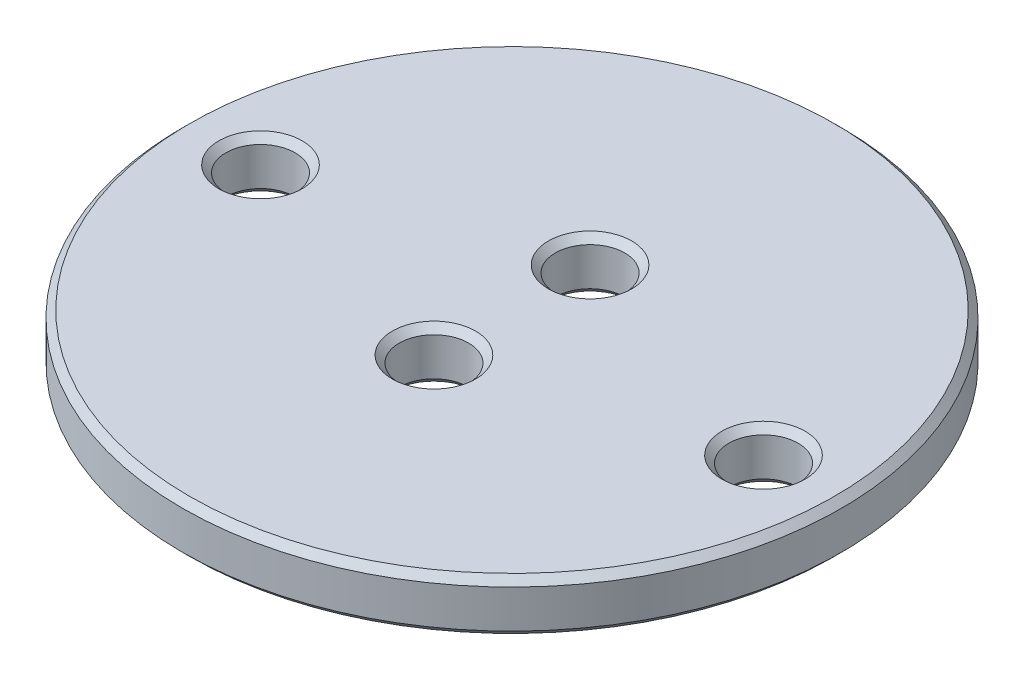
ISO-10303-21;
HEADER;
FILE_DESCRIPTION(('STEP AP214'),'2;1');
FILE_NAME('part.step','',(''),(''),'','','');
FILE_SCHEMA(('AUTOMOTIVE_DESIGN { 1 0 10303 214 1 1 1 1 }'));
ENDSEC;
DATA;
#1=APPLICATION_CONTEXT('core data for automotive mechanical design processes');
#2=APPLICATION_PROTOCOL_DEFINITION('international standard','automotive_design',2000,#1);
#3=PRODUCT_CONTEXT('',#1,'mechanical');
#4=PRODUCT('Part','Part','',(#3));
#5=PRODUCT_RELATED_PRODUCT_CATEGORY('part','',(#4));
#6=PRODUCT_DEFINITION_FORMATION('','',#4);
#7=PRODUCT_DEFINITION_CONTEXT('part definition',#1,'design');
#8=PRODUCT_DEFINITION('design','',#6,#7);
#9=PRODUCT_DEFINITION_SHAPE('','',#8);
#10=(LENGTH_UNIT() NAMED_UNIT(*) SI_UNIT(.MILLI.,.METRE.));
#11=(NAMED_UNIT(*) PLANE_ANGLE_UNIT() SI_UNIT($,.RADIAN.));
#12=(NAMED_UNIT(*) SI_UNIT($,.STERADIAN.) SOLID_ANGLE_UNIT());
#13=UNCERTAINTY_MEASURE_WITH_UNIT(LENGTH_MEASURE(1.E-05),#10,'distance_accuracy_value','');
#14=(GEOMETRIC_REPRESENTATION_CONTEXT(3) GLOBAL_UNCERTAINTY_ASSIGNED_CONTEXT((#13)) GLOBAL_UNIT_ASSIGNED_CONTEXT((#10,
#11,#12)) REPRESENTATION_CONTEXT('',''));
#15=CARTESIAN_POINT('',(0.,0.,0.));
#16=DIRECTION('',(0.,0.,1.));
#17=DIRECTION('',(1.,0.,0.));
#18=AXIS2_PLACEMENT_3D('',#15,#16,#17);
#19=CARTESIAN_POINT('',(0.,3.,0.));
#20=DIRECTION('',(0.,1.,0.));
#21=DIRECTION('',(0.,0.,1.));
#22=AXIS2_PLACEMENT_3D('',#19,#20,#21);
#23=PLANE('',#22);
#24=CARTESIAN_POINT('',(0.,3.,4.5));
#25=DIRECTION('',(0.,1.,0.));
#26=DIRECTION('',(0.,0.,1.));
#27=AXIS2_PLACEMENT_3D('',#24,#25,#26);
#28=CIRCLE('',#27,2.40000000000001);
#29=CARTESIAN_POINT('',(0.,3.,6.90000000000001));
#30=VERTEX_POINT('',#29);
#31=EDGE_CURVE('E10',#30,#30,#28,.F.);
#32=ORIENTED_EDGE('',*,*,#31,.T.);
#33=EDGE_LOOP('',(#32));
#34=FACE_BOUND('',#33,.T.);
#35=CARTESIAN_POINT('',(14.5,3.,0.));
#36=DIRECTION('',(0.,1.,0.));
#37=DIRECTION('',(0.,0.,1.));
#38=AXIS2_PLACEMENT_3D('',#35,#36,#37);
#39=CIRCLE('',#38,2.40000000000001);
#40=CARTESIAN_POINT('',(14.5,3.,2.4));
#41=VERTEX_POINT('',#40);
#42=EDGE_CURVE('E52',#41,#41,#39,.F.);
#43=ORIENTED_EDGE('',*,*,#42,.T.);
#44=EDGE_LOOP('',(#43));
#45=FACE_BOUND('',#44,.T.);
#46=CARTESIAN_POINT('',(0.,3.,0.));
#47=DIRECTION('',(0.,1.,0.));
#48=DIRECTION('',(0.,0.,1.));
#49=AXIS2_PLACEMENT_3D('',#46,#47,#48);
#50=CIRCLE('',#49,18.6);
#51=CARTESIAN_POINT('',(0.,3.,18.6));
#52=VERTEX_POINT('',#51);
#53=EDGE_CURVE('E57',#52,#52,#50,.T.);
#54=ORIENTED_EDGE('',*,*,#53,.T.);
#55=EDGE_LOOP('',(#54));
#56=FACE_BOUND('',#55,.T.);
#57=CARTESIAN_POINT('',(-14.5,3.,0.));
#58=DIRECTION('',(0.,1.,0.));
#59=DIRECTION('',(0.,0.,1.));
#60=AXIS2_PLACEMENT_3D('',#57,#58,#59);
#61=CIRCLE('',#60,2.40000000000001);
#62=CARTESIAN_POINT('',(-14.5,3.,2.40000000000001));
#63=VERTEX_POINT('',#62);
#64=EDGE_CURVE('E62',#63,#63,#61,.F.);
#65=ORIENTED_EDGE('',*,*,#64,.T.);
#66=EDGE_LOOP('',(#65));
#67=FACE_BOUND('',#66,.T.);
#68=CARTESIAN_POINT('',(0.,3.,-4.5));
#69=DIRECTION('',(0.,1.,0.));
#70=DIRECTION('',(0.,0.,1.));
#71=AXIS2_PLACEMENT_3D('',#68,#69,#70);
#72=CIRCLE('',#71,2.40000000000001);
#73=CARTESIAN_POINT('',(0.,3.,-2.09999999999999));
#74=VERTEX_POINT('',#73);
#75=EDGE_CURVE('E68',#74,#74,#72,.F.);
#76=ORIENTED_EDGE('',*,*,#75,.T.);
#77=EDGE_LOOP('',(#76));
#78=FACE_BOUND('',#77,.T.);
#79=ADVANCED_FACE('F43',(#34,#45,#56,#67,#78),#23,.T.);
#80=CARTESIAN_POINT('',(0.,0.,0.));
#81=DIRECTION('',(0.,1.,0.));
#82=DIRECTION('',(0.,0.,1.));
#83=AXIS2_PLACEMENT_3D('',#80,#81,#82);
#84=PLANE('',#83);
#85=CARTESIAN_POINT('',(0.,0.,4.5));
#86=DIRECTION('',(0.,1.,0.));
#87=DIRECTION('',(0.,0.,1.));
#88=AXIS2_PLACEMENT_3D('',#85,#86,#87);
#89=CIRCLE('',#88,2.4);
#90=CARTESIAN_POINT('',(0.,0.,6.9));
#91=VERTEX_POINT('',#90);
#92=EDGE_CURVE('E112',#91,#91,#89,.T.);
#93=ORIENTED_EDGE('',*,*,#92,.T.);
#94=EDGE_LOOP('',(#93));
#95=FACE_BOUND('',#94,.T.);
#96=CARTESIAN_POINT('',(0.,0.,-4.5));
#97=DIRECTION('',(0.,1.,0.));
#98=DIRECTION('',(0.,0.,1.));
#99=AXIS2_PLACEMENT_3D('',#96,#97,#98);
#100=CIRCLE('',#99,2.4);
#101=CARTESIAN_POINT('',(0.,0.,-2.1));
#102=VERTEX_POINT('',#101);
#103=EDGE_CURVE('E116',#102,#102,#100,.T.);
#104=ORIENTED_EDGE('',*,*,#103,.T.);
#105=EDGE_LOOP('',(#104));
#106=FACE_BOUND('',#105,.T.);
#107=CARTESIAN_POINT('',(14.5,0.,0.));
#108=DIRECTION('',(0.,1.,0.));
#109=DIRECTION('',(0.,0.,1.));
#110=AXIS2_PLACEMENT_3D('',#107,#108,#109);
#111=CIRCLE('',#110,2.4);
#112=CARTESIAN_POINT('',(14.5,0.,2.39999999999999));
#113=VERTEX_POINT('',#112);
#114=EDGE_CURVE('E120',#113,#113,#111,.T.);
#115=ORIENTED_EDGE('',*,*,#114,.T.);
#116=EDGE_LOOP('',(#115));
#117=FACE_BOUND('',#116,.T.);
#118=CARTESIAN_POINT('',(-14.5,0.,0.));
#119=DIRECTION('',(0.,1.,0.));
#120=DIRECTION('',(0.,0.,1.));
#121=AXIS2_PLACEMENT_3D('',#118,#119,#120);
#122=CIRCLE('',#121,2.4);
#123=CARTESIAN_POINT('',(-14.5,0.,2.4));
#124=VERTEX_POINT('',#123);
#125=EDGE_CURVE('E124',#124,#124,#122,.T.);
#126=ORIENTED_EDGE('',*,*,#125,.T.);
#127=EDGE_LOOP('',(#126));
#128=FACE_BOUND('',#127,.T.);
#129=CARTESIAN_POINT('',(0.,0.,0.));
#130=DIRECTION('',(0.,1.,0.));
#131=DIRECTION('',(0.,0.,1.));
#132=AXIS2_PLACEMENT_3D('',#129,#130,#131);
#133=CIRCLE('',#132,18.6);
#134=CARTESIAN_POINT('',(0.,0.,18.6));
#135=VERTEX_POINT('',#134);
#136=EDGE_CURVE('E128',#135,#135,#133,.F.);
#137=ORIENTED_EDGE('',*,*,#136,.T.);
#138=EDGE_LOOP('',(#137));
#139=FACE_BOUND('',#138,.T.);
#140=ADVANCED_FACE('F133',(#95,#106,#117,#128,#139),#84,.F.);
#141=CARTESIAN_POINT('',(0.,3.,0.));
#142=DIRECTION('',(0.,-1.,0.));
#143=DIRECTION('',(0.,0.,-1.));
#144=AXIS2_PLACEMENT_3D('',#141,#142,#143);
#145=CYLINDRICAL_SURFACE('',#144,19.);
#146=CARTESIAN_POINT('',(0.,0.400000000000001,0.));
#147=DIRECTION('',(0.,1.,0.));
#148=DIRECTION('',(0.,0.,1.));
#149=AXIS2_PLACEMENT_3D('',#146,#147,#148);
#150=CIRCLE('',#149,19.);
#151=CARTESIAN_POINT('',(0.,0.400000000000001,19.));
#152=VERTEX_POINT('',#151);
#153=EDGE_CURVE('E72',#152,#152,#150,.T.);
#154=ORIENTED_EDGE('',*,*,#153,.T.);
#155=EDGE_LOOP('',(#154));
#156=FACE_BOUND('',#155,.T.);
#157=CARTESIAN_POINT('',(0.,2.6,0.));
#158=DIRECTION('',(0.,1.,0.));
#159=DIRECTION('',(0.,0.,1.));
#160=AXIS2_PLACEMENT_3D('',#157,#158,#159);
#161=CIRCLE('',#160,19.);
#162=CARTESIAN_POINT('',(0.,2.6,19.));
#163=VERTEX_POINT('',#162);
#164=EDGE_CURVE('E76',#163,#163,#161,.F.);
#165=ORIENTED_EDGE('',*,*,#164,.T.);
#166=EDGE_LOOP('',(#165));
#167=FACE_BOUND('',#166,.T.);
#168=ADVANCED_FACE('F143',(#156,#167),#145,.T.);
#169=CARTESIAN_POINT('',(-14.5,3.,0.));
#170=DIRECTION('',(0.,-1.,0.));
#171=DIRECTION('',(0.,0.,-1.));
#172=AXIS2_PLACEMENT_3D('',#169,#170,#171);
#173=CYLINDRICAL_SURFACE('',#172,2.);
#174=CARTESIAN_POINT('',(-14.5,0.4,0.));
#175=DIRECTION('',(0.,1.,0.));
#176=DIRECTION('',(0.,0.,1.));
#177=AXIS2_PLACEMENT_3D('',#174,#175,#176);
#178=CIRCLE('',#177,2.);
#179=CARTESIAN_POINT('',(-14.5,0.4,2.));
#180=VERTEX_POINT('',#179);
#181=EDGE_CURVE('E80',#180,#180,#178,.F.);
#182=ORIENTED_EDGE('',*,*,#181,.T.);
#183=EDGE_LOOP('',(#182));
#184=FACE_BOUND('',#183,.T.);
#185=CARTESIAN_POINT('',(-14.5,2.59999999999999,0.));
#186=DIRECTION('',(0.,1.,0.));
#187=DIRECTION('',(0.,0.,1.));
#188=AXIS2_PLACEMENT_3D('',#185,#186,#187);
#189=CIRCLE('',#188,2.);
#190=CARTESIAN_POINT('',(-14.5,2.59999999999999,2.));
#191=VERTEX_POINT('',#190);
#192=EDGE_CURVE('E84',#191,#191,#189,.T.);
#193=ORIENTED_EDGE('',*,*,#192,.T.);
#194=EDGE_LOOP('',(#193));
#195=FACE_BOUND('',#194,.T.);
#196=ADVANCED_FACE('F146',(#184,#195),#173,.F.);
#197=CARTESIAN_POINT('',(14.5,3.,0.));
#198=DIRECTION('',(0.,-1.,0.));
#199=DIRECTION('',(0.,0.,-1.));
#200=AXIS2_PLACEMENT_3D('',#197,#198,#199);
#201=CYLINDRICAL_SURFACE('',#200,2.);
#202=CARTESIAN_POINT('',(14.5,0.399999999999999,0.));
#203=DIRECTION('',(0.,1.,0.));
#204=DIRECTION('',(0.,0.,1.));
#205=AXIS2_PLACEMENT_3D('',#202,#203,#204);
#206=CIRCLE('',#205,2.);
#207=CARTESIAN_POINT('',(14.5,0.399999999999999,2.));
#208=VERTEX_POINT('',#207);
#209=EDGE_CURVE('E88',#208,#208,#206,.F.);
#210=ORIENTED_EDGE('',*,*,#209,.T.);
#211=EDGE_LOOP('',(#210));
#212=FACE_BOUND('',#211,.T.);
#213=CARTESIAN_POINT('',(14.5,2.6,0.));
#214=DIRECTION('',(0.,1.,0.));
#215=DIRECTION('',(0.,0.,1.));
#216=AXIS2_PLACEMENT_3D('',#213,#214,#215);
#217=CIRCLE('',#216,2.);
#218=CARTESIAN_POINT('',(14.5,2.6,2.));
#219=VERTEX_POINT('',#218);
#220=EDGE_CURVE('E92',#219,#219,#217,.T.);
#221=ORIENTED_EDGE('',*,*,#220,.T.);
#222=EDGE_LOOP('',(#221));
#223=FACE_BOUND('',#222,.T.);
#224=ADVANCED_FACE('F172',(#212,#223),#201,.F.);
#225=CARTESIAN_POINT('',(0.,3.,-4.5));
#226=DIRECTION('',(0.,-1.,0.));
#227=DIRECTION('',(0.,0.,-1.));
#228=AXIS2_PLACEMENT_3D('',#225,#226,#227);
#229=CYLINDRICAL_SURFACE('',#228,2.);
#230=CARTESIAN_POINT('',(0.,0.400000000000003,-4.5));
#231=DIRECTION('',(0.,1.,0.));
#232=DIRECTION('',(0.,0.,1.));
#233=AXIS2_PLACEMENT_3D('',#230,#231,#232);
#234=CIRCLE('',#233,2.);
#235=CARTESIAN_POINT('',(0.,0.400000000000003,-2.5));
#236=VERTEX_POINT('',#235);
#237=EDGE_CURVE('E96',#236,#236,#234,.F.);
#238=ORIENTED_EDGE('',*,*,#237,.T.);
#239=EDGE_LOOP('',(#238));
#240=FACE_BOUND('',#239,.T.);
#241=CARTESIAN_POINT('',(0.,2.59999999999999,-4.5));
#242=DIRECTION('',(0.,1.,0.));
#243=DIRECTION('',(0.,0.,1.));
#244=AXIS2_PLACEMENT_3D('',#241,#242,#243);
#245=CIRCLE('',#244,2.);
#246=CARTESIAN_POINT('',(0.,2.59999999999999,-2.5));
#247=VERTEX_POINT('',#246);
#248=EDGE_CURVE('E100',#247,#247,#245,.T.);
#249=ORIENTED_EDGE('',*,*,#248,.T.);
#250=EDGE_LOOP('',(#249));
#251=FACE_BOUND('',#250,.T.);
#252=ADVANCED_FACE('F169',(#240,#251),#229,.F.);
#253=CARTESIAN_POINT('',(0.,3.,4.5));
#254=DIRECTION('',(0.,-1.,0.));
#255=DIRECTION('',(0.,0.,-1.));
#256=AXIS2_PLACEMENT_3D('',#253,#254,#255);
#257=CYLINDRICAL_SURFACE('',#256,2.);
#258=CARTESIAN_POINT('',(0.,0.4,4.5));
#259=DIRECTION('',(0.,1.,0.));
#260=DIRECTION('',(0.,0.,1.));
#261=AXIS2_PLACEMENT_3D('',#258,#259,#260);
#262=CIRCLE('',#261,2.);
#263=CARTESIAN_POINT('',(0.,0.4,6.5));
#264=VERTEX_POINT('',#263);
#265=EDGE_CURVE('E104',#264,#264,#262,.F.);
#266=ORIENTED_EDGE('',*,*,#265,.T.);
#267=EDGE_LOOP('',(#266));
#268=FACE_BOUND('',#267,.T.);
#269=CARTESIAN_POINT('',(0.,2.59999999999999,4.5));
#270=DIRECTION('',(0.,1.,0.));
#271=DIRECTION('',(0.,0.,1.));
#272=AXIS2_PLACEMENT_3D('',#269,#270,#271);
#273=CIRCLE('',#272,2.);
#274=CARTESIAN_POINT('',(0.,2.59999999999999,6.5));
#275=VERTEX_POINT('',#274);
#276=EDGE_CURVE('E108',#275,#275,#273,.T.);
#277=ORIENTED_EDGE('',*,*,#276,.T.);
#278=EDGE_LOOP('',(#277));
#279=FACE_BOUND('',#278,.T.);
#280=ADVANCED_FACE('F171',(#268,#279),#257,.F.);
#281=CARTESIAN_POINT('',(0.,0.,4.5));
#282=DIRECTION('',(0.,-1.,0.));
#283=DIRECTION('',(0.,0.,-1.));
#284=AXIS2_PLACEMENT_3D('',#281,#282,#283);
#285=CONICAL_SURFACE('',#284,2.4,0.785398163397447);
#286=ORIENTED_EDGE('',*,*,#265,.F.);
#287=EDGE_LOOP('',(#286));
#288=FACE_BOUND('',#287,.T.);
#289=ORIENTED_EDGE('',*,*,#92,.F.);
#290=EDGE_LOOP('',(#289));
#291=FACE_BOUND('',#290,.T.);
#292=ADVANCED_FACE('F179',(#288,#291),#285,.F.);
#293=CARTESIAN_POINT('',(0.,0.,-4.5));
#294=DIRECTION('',(0.,-1.,0.));
#295=DIRECTION('',(0.,0.,-1.));
#296=AXIS2_PLACEMENT_3D('',#293,#294,#295);
#297=CONICAL_SURFACE('',#296,2.4,0.785398163397444);
#298=ORIENTED_EDGE('',*,*,#237,.F.);
#299=EDGE_LOOP('',(#298));
#300=FACE_BOUND('',#299,.T.);
#301=ORIENTED_EDGE('',*,*,#103,.F.);
#302=EDGE_LOOP('',(#301));
#303=FACE_BOUND('',#302,.T.);
#304=ADVANCED_FACE('F197',(#300,#303),#297,.F.);
#305=CARTESIAN_POINT('',(14.5,0.,0.));
#306=DIRECTION('',(0.,-1.,0.));
#307=DIRECTION('',(0.,0.,-1.));
#308=AXIS2_PLACEMENT_3D('',#305,#306,#307);
#309=CONICAL_SURFACE('',#308,2.4,0.785398163397447);
#310=ORIENTED_EDGE('',*,*,#209,.F.);
#311=EDGE_LOOP('',(#310));
#312=FACE_BOUND('',#311,.T.);
#313=ORIENTED_EDGE('',*,*,#114,.F.);
#314=EDGE_LOOP('',(#313));
#315=FACE_BOUND('',#314,.T.);
#316=ADVANCED_FACE('F204',(#312,#315),#309,.F.);
#317=CARTESIAN_POINT('',(-14.5,0.,0.));
#318=DIRECTION('',(0.,-1.,0.));
#319=DIRECTION('',(0.,0.,-1.));
#320=AXIS2_PLACEMENT_3D('',#317,#318,#319);
#321=CONICAL_SURFACE('',#320,2.4,0.785398163397448);
#322=ORIENTED_EDGE('',*,*,#181,.F.);
#323=EDGE_LOOP('',(#322));
#324=FACE_BOUND('',#323,.T.);
#325=ORIENTED_EDGE('',*,*,#125,.F.);
#326=EDGE_LOOP('',(#325));
#327=FACE_BOUND('',#326,.T.);
#328=ADVANCED_FACE('F139',(#324,#327),#321,.F.);
#329=CARTESIAN_POINT('',(0.,0.400000000000001,0.));
#330=DIRECTION('',(0.,1.,0.));
#331=DIRECTION('',(0.,0.,1.));
#332=AXIS2_PLACEMENT_3D('',#329,#330,#331);
#333=CONICAL_SURFACE('',#332,19.,0.785398163397453);
#334=ORIENTED_EDGE('',*,*,#136,.F.);
#335=EDGE_LOOP('',(#334));
#336=FACE_BOUND('',#335,.T.);
#337=ORIENTED_EDGE('',*,*,#153,.F.);
#338=EDGE_LOOP('',(#337));
#339=FACE_BOUND('',#338,.T.);
#340=ADVANCED_FACE('F135',(#336,#339),#333,.T.);
#341=CARTESIAN_POINT('',(0.,2.59999999999999,4.5));
#342=DIRECTION('',(0.,1.,0.));
#343=DIRECTION('',(0.,0.,1.));
#344=AXIS2_PLACEMENT_3D('',#341,#342,#343);
#345=CONICAL_SURFACE('',#344,2.,0.785398163397449);
#346=ORIENTED_EDGE('',*,*,#31,.F.);
#347=EDGE_LOOP('',(#346));
#348=FACE_BOUND('',#347,.T.);
#349=ORIENTED_EDGE('',*,*,#276,.F.);
#350=EDGE_LOOP('',(#349));
#351=FACE_BOUND('',#350,.T.);
#352=ADVANCED_FACE('F138',(#348,#351),#345,.F.);
#353=CARTESIAN_POINT('',(14.5,2.6,0.));
#354=DIRECTION('',(0.,1.,0.));
#355=DIRECTION('',(0.,0.,1.));
#356=AXIS2_PLACEMENT_3D('',#353,#354,#355);
#357=CONICAL_SURFACE('',#356,2.,0.785398163397449);
#358=ORIENTED_EDGE('',*,*,#42,.F.);
#359=EDGE_LOOP('',(#358));
#360=FACE_BOUND('',#359,.T.);
#361=ORIENTED_EDGE('',*,*,#220,.F.);
#362=EDGE_LOOP('',(#361));
#363=FACE_BOUND('',#362,.T.);
#364=ADVANCED_FACE('F154',(#360,#363),#357,.F.);
#365=CARTESIAN_POINT('',(0.,3.,0.));
#366=DIRECTION('',(0.,-1.,0.));
#367=DIRECTION('',(0.,0.,-1.));
#368=AXIS2_PLACEMENT_3D('',#365,#366,#367);
#369=CONICAL_SURFACE('',#368,18.6,0.785398163397444);
#370=ORIENTED_EDGE('',*,*,#164,.F.);
#371=EDGE_LOOP('',(#370));
#372=FACE_BOUND('',#371,.T.);
#373=ORIENTED_EDGE('',*,*,#53,.F.);
#374=EDGE_LOOP('',(#373));
#375=FACE_BOUND('',#374,.T.);
#376=ADVANCED_FACE('F150',(#372,#375),#369,.T.);
#377=CARTESIAN_POINT('',(-14.5,2.59999999999999,0.));
#378=DIRECTION('',(0.,1.,0.));
#379=DIRECTION('',(0.,0.,1.));
#380=AXIS2_PLACEMENT_3D('',#377,#378,#379);
#381=CONICAL_SURFACE('',#380,2.,0.785398163397449);
#382=ORIENTED_EDGE('',*,*,#64,.F.);
#383=EDGE_LOOP('',(#382));
#384=FACE_BOUND('',#383,.T.);
#385=ORIENTED_EDGE('',*,*,#192,.F.);
#386=EDGE_LOOP('',(#385));
#387=FACE_BOUND('',#386,.T.);
#388=ADVANCED_FACE('F153',(#384,#387),#381,.F.);
#389=CARTESIAN_POINT('',(0.,2.59999999999999,-4.5));
#390=DIRECTION('',(0.,1.,0.));
#391=DIRECTION('',(0.,0.,1.));
#392=AXIS2_PLACEMENT_3D('',#389,#390,#391);
#393=CONICAL_SURFACE('',#392,2.,0.785398163397449);
#394=ORIENTED_EDGE('',*,*,#75,.F.);
#395=EDGE_LOOP('',(#394));
#396=FACE_BOUND('',#395,.T.);
#397=ORIENTED_EDGE('',*,*,#248,.F.);
#398=EDGE_LOOP('',(#397));
#399=FACE_BOUND('',#398,.T.);
#400=ADVANCED_FACE('F46',(#396,#399),#393,.F.);
#401=CLOSED_SHELL('',(#79,#140,#168,#196,#224,#252,#280,#292,#304,#316,#328,#340,#352,#364,#376,
#388,#400));
#402=MANIFOLD_SOLID_BREP('B2',#401);
#403=ADVANCED_BREP_SHAPE_REPRESENTATION('',(#18,#402),#14);
#404=SHAPE_DEFINITION_REPRESENTATION(#9,#403);
ENDSEC;
END-ISO-10303-21;
